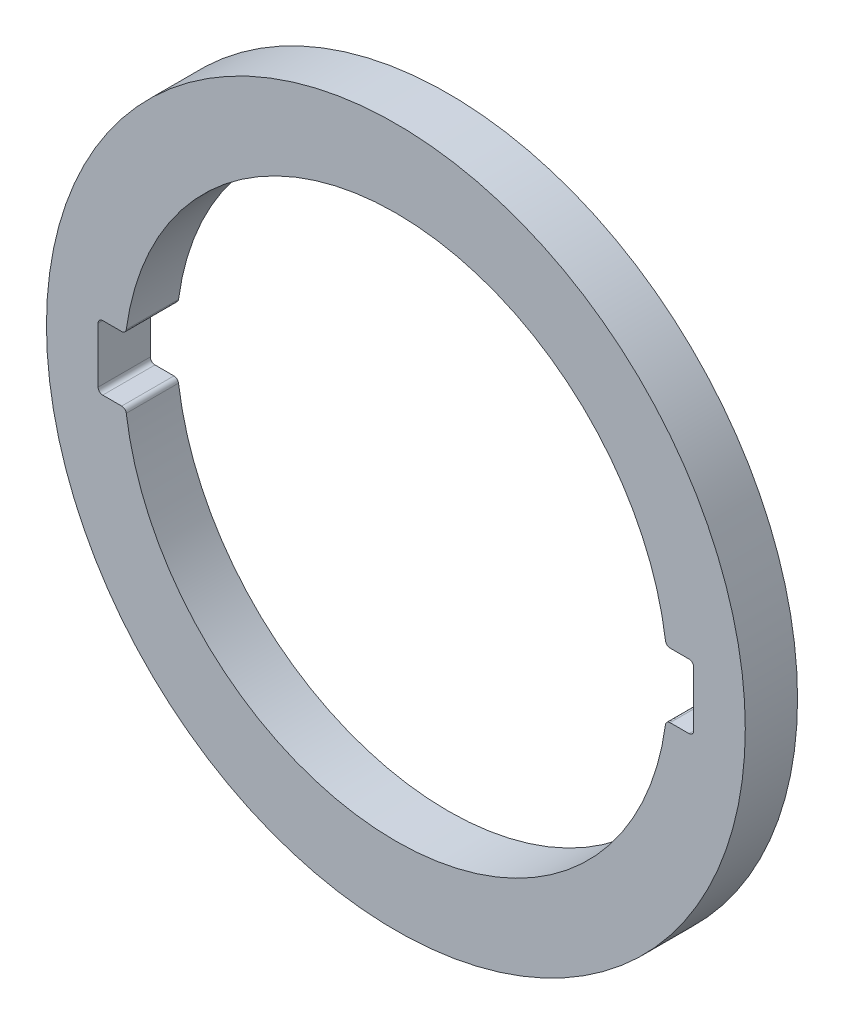
ISO-10303-21;
HEADER;
FILE_DESCRIPTION(('STEP AP214'),'2;1');
FILE_NAME('part.step','',(''),(''),'','','');
FILE_SCHEMA(('AUTOMOTIVE_DESIGN { 1 0 10303 214 1 1 1 1 }'));
ENDSEC;
DATA;
#1=APPLICATION_CONTEXT('core data for automotive mechanical design processes');
#2=APPLICATION_PROTOCOL_DEFINITION('international standard','automotive_design',2000,#1);
#3=PRODUCT_CONTEXT('',#1,'mechanical');
#4=PRODUCT('Part','Part','',(#3));
#5=PRODUCT_RELATED_PRODUCT_CATEGORY('part','',(#4));
#6=PRODUCT_DEFINITION_FORMATION('','',#4);
#7=PRODUCT_DEFINITION_CONTEXT('part definition',#1,'design');
#8=PRODUCT_DEFINITION('design','',#6,#7);
#9=PRODUCT_DEFINITION_SHAPE('','',#8);
#10=(LENGTH_UNIT() NAMED_UNIT(*) SI_UNIT(.MILLI.,.METRE.));
#11=(NAMED_UNIT(*) PLANE_ANGLE_UNIT() SI_UNIT($,.RADIAN.));
#12=(NAMED_UNIT(*) SI_UNIT($,.STERADIAN.) SOLID_ANGLE_UNIT());
#13=UNCERTAINTY_MEASURE_WITH_UNIT(LENGTH_MEASURE(1.E-05),#10,'distance_accuracy_value','');
#14=(GEOMETRIC_REPRESENTATION_CONTEXT(3) GLOBAL_UNCERTAINTY_ASSIGNED_CONTEXT((#13)) GLOBAL_UNIT_ASSIGNED_CONTEXT((#10,
#11,#12)) REPRESENTATION_CONTEXT('',''));
#15=CARTESIAN_POINT('',(0.,0.,0.));
#16=DIRECTION('',(0.,0.,1.));
#17=DIRECTION('',(1.,0.,0.));
#18=AXIS2_PLACEMENT_3D('',#15,#16,#17);
#19=CARTESIAN_POINT('',(-290.901455233013,947.499999999996,-140.));
#20=DIRECTION('',(0.,0.,1.));
#21=DIRECTION('',(1.,0.,0.));
#22=AXIS2_PLACEMENT_3D('',#19,#20,#21);
#23=CYLINDRICAL_SURFACE('',#22,1136.77987900954);
#24=CARTESIAN_POINT('',(-290.901455233013,947.499999999996,-140.));
#25=DIRECTION('',(0.,0.,1.));
#26=DIRECTION('',(1.,0.,0.));
#27=AXIS2_PLACEMENT_3D('',#24,#25,#26);
#28=CIRCLE('',#27,1136.77987900954);
#29=CARTESIAN_POINT('',(845.878423776529,947.499999999996,-140.));
#30=VERTEX_POINT('',#29);
#31=EDGE_CURVE('E238',#30,#30,#28,.T.);
#32=ORIENTED_EDGE('',*,*,#31,.T.);
#33=EDGE_LOOP('',(#32));
#34=FACE_BOUND('',#33,.T.);
#35=CARTESIAN_POINT('',(-290.901455233013,947.499999999996,30.));
#36=DIRECTION('',(0.,0.,1.));
#37=DIRECTION('',(1.,0.,0.));
#38=AXIS2_PLACEMENT_3D('',#35,#36,#37);
#39=CIRCLE('',#38,1136.77987900954);
#40=CARTESIAN_POINT('',(845.878423776529,947.499999999996,30.));
#41=VERTEX_POINT('',#40);
#42=EDGE_CURVE('E203',#41,#41,#39,.T.);
#43=ORIENTED_EDGE('',*,*,#42,.F.);
#44=EDGE_LOOP('',(#43));
#45=FACE_BOUND('',#44,.T.);
#46=ADVANCED_FACE('F36',(#34,#45),#23,.T.);
#47=CARTESIAN_POINT('',(-290.901455233013,947.499999999996,-140.));
#48=DIRECTION('',(0.,0.,1.));
#49=DIRECTION('',(1.,0.,0.));
#50=AXIS2_PLACEMENT_3D('',#47,#48,#49);
#51=PLANE('',#50);
#52=DIRECTION('',(1.,0.,0.));
#53=VECTOR('',#52,1.);
#54=CARTESIAN_POINT('',(-1169.65056618562,842.499999999996,-140.));
#55=LINE('',#54,#53);
#56=CARTESIAN_POINT('',(-1244.65056618562,842.499999999996,-140.));
#57=VERTEX_POINT('',#56);
#58=CARTESIAN_POINT('',(-1182.86558007212,842.499999999996,-140.));
#59=VERTEX_POINT('',#58);
#60=EDGE_CURVE('E170',#57,#59,#55,.T.);
#61=ORIENTED_EDGE('',*,*,#60,.T.);
#62=CARTESIAN_POINT('',(-1182.86558007212,827.499999999996,-140.));
#63=DIRECTION('',(0.,0.,1.));
#64=DIRECTION('',(1.,0.,0.));
#65=AXIS2_PLACEMENT_3D('',#62,#63,#64);
#66=CIRCLE('',#65,15.);
#67=CARTESIAN_POINT('',(-1167.9995113248,829.499999999996,-140.));
#68=VERTEX_POINT('',#67);
#69=EDGE_CURVE('E273',#59,#68,#66,.F.);
#70=ORIENTED_EDGE('',*,*,#69,.T.);
#71=CARTESIAN_POINT('',(-290.901455233013,947.499999999996,-140.));
#72=DIRECTION('',(0.,0.,1.));
#73=DIRECTION('',(1.,0.,0.));
#74=AXIS2_PLACEMENT_3D('',#71,#72,#73);
#75=CIRCLE('',#74,885.);
#76=CARTESIAN_POINT('',(586.196600858779,829.499999999996,-140.));
#77=VERTEX_POINT('',#76);
#78=EDGE_CURVE('E206',#68,#77,#75,.T.);
#79=ORIENTED_EDGE('',*,*,#78,.T.);
#80=CARTESIAN_POINT('',(601.062669606097,827.499999999996,-140.));
#81=DIRECTION('',(0.,0.,1.));
#82=DIRECTION('',(1.,0.,0.));
#83=AXIS2_PLACEMENT_3D('',#80,#81,#82);
#84=CIRCLE('',#83,15.);
#85=CARTESIAN_POINT('',(601.062669606097,842.499999999996,-140.));
#86=VERTEX_POINT('',#85);
#87=EDGE_CURVE('E270',#77,#86,#84,.F.);
#88=ORIENTED_EDGE('',*,*,#87,.T.);
#89=DIRECTION('',(1.,0.,0.));
#90=VECTOR('',#89,1.);
#91=CARTESIAN_POINT('',(587.847655719596,842.499999999996,-140.));
#92=LINE('',#91,#90);
#93=CARTESIAN_POINT('',(662.847655719595,842.499999999996,-140.));
#94=VERTEX_POINT('',#93);
#95=EDGE_CURVE('E209',#86,#94,#92,.T.);
#96=ORIENTED_EDGE('',*,*,#95,.T.);
#97=CARTESIAN_POINT('',(662.847655719595,857.499999999996,-140.));
#98=DIRECTION('',(0.,0.,1.));
#99=DIRECTION('',(1.,0.,0.));
#100=AXIS2_PLACEMENT_3D('',#97,#98,#99);
#101=CIRCLE('',#100,15.);
#102=CARTESIAN_POINT('',(677.847655719596,857.499999999996,-140.));
#103=VERTEX_POINT('',#102);
#104=EDGE_CURVE('E168',#94,#103,#101,.T.);
#105=ORIENTED_EDGE('',*,*,#104,.T.);
#106=DIRECTION('',(0.,1.,0.));
#107=VECTOR('',#106,1.);
#108=CARTESIAN_POINT('',(677.847655719596,857.499999999996,-140.));
#109=LINE('',#108,#107);
#110=CARTESIAN_POINT('',(677.847655719596,1037.5,-140.));
#111=VERTEX_POINT('',#110);
#112=EDGE_CURVE('E212',#103,#111,#109,.T.);
#113=ORIENTED_EDGE('',*,*,#112,.T.);
#114=CARTESIAN_POINT('',(662.847655719595,1037.5,-140.));
#115=DIRECTION('',(0.,0.,1.));
#116=DIRECTION('',(1.,0.,0.));
#117=AXIS2_PLACEMENT_3D('',#114,#115,#116);
#118=CIRCLE('',#117,15.);
#119=CARTESIAN_POINT('',(662.847655719595,1052.5,-140.));
#120=VERTEX_POINT('',#119);
#121=EDGE_CURVE('E215',#111,#120,#118,.T.);
#122=ORIENTED_EDGE('',*,*,#121,.T.);
#123=DIRECTION('',(-1.,0.,0.));
#124=VECTOR('',#123,1.);
#125=CARTESIAN_POINT('',(662.847655719595,1052.5,-140.));
#126=LINE('',#125,#124);
#127=CARTESIAN_POINT('',(601.062669606097,1052.5,-140.));
#128=VERTEX_POINT('',#127);
#129=EDGE_CURVE('E218',#120,#128,#126,.T.);
#130=ORIENTED_EDGE('',*,*,#129,.T.);
#131=CARTESIAN_POINT('',(601.062669606097,1067.5,-140.));
#132=DIRECTION('',(0.,0.,1.));
#133=DIRECTION('',(1.,0.,0.));
#134=AXIS2_PLACEMENT_3D('',#131,#132,#133);
#135=CIRCLE('',#134,15.);
#136=CARTESIAN_POINT('',(586.196600858779,1065.5,-140.));
#137=VERTEX_POINT('',#136);
#138=EDGE_CURVE('E268',#128,#137,#135,.F.);
#139=ORIENTED_EDGE('',*,*,#138,.T.);
#140=CARTESIAN_POINT('',(-290.901455233013,947.499999999996,-140.));
#141=DIRECTION('',(0.,0.,1.));
#142=DIRECTION('',(1.,0.,0.));
#143=AXIS2_PLACEMENT_3D('',#140,#141,#142);
#144=CIRCLE('',#143,885.);
#145=CARTESIAN_POINT('',(-1167.9995113248,1065.5,-140.));
#146=VERTEX_POINT('',#145);
#147=EDGE_CURVE('E221',#137,#146,#144,.T.);
#148=ORIENTED_EDGE('',*,*,#147,.T.);
#149=CARTESIAN_POINT('',(-1182.86558007212,1067.5,-140.));
#150=DIRECTION('',(0.,0.,1.));
#151=DIRECTION('',(1.,0.,0.));
#152=AXIS2_PLACEMENT_3D('',#149,#150,#151);
#153=CIRCLE('',#152,15.);
#154=CARTESIAN_POINT('',(-1182.86558007212,1052.5,-140.));
#155=VERTEX_POINT('',#154);
#156=EDGE_CURVE('E51',#146,#155,#153,.F.);
#157=ORIENTED_EDGE('',*,*,#156,.T.);
#158=DIRECTION('',(-1.,0.,0.));
#159=VECTOR('',#158,1.);
#160=CARTESIAN_POINT('',(-1244.65056618562,1052.5,-140.));
#161=LINE('',#160,#159);
#162=CARTESIAN_POINT('',(-1244.65056618562,1052.5,-140.));
#163=VERTEX_POINT('',#162);
#164=EDGE_CURVE('E223',#155,#163,#161,.T.);
#165=ORIENTED_EDGE('',*,*,#164,.T.);
#166=CARTESIAN_POINT('',(-1244.65056618562,1037.5,-140.));
#167=DIRECTION('',(0.,0.,1.));
#168=DIRECTION('',(-1.,0.,0.));
#169=AXIS2_PLACEMENT_3D('',#166,#167,#168);
#170=CIRCLE('',#169,15.);
#171=CARTESIAN_POINT('',(-1259.65056618562,1037.5,-140.));
#172=VERTEX_POINT('',#171);
#173=EDGE_CURVE('E225',#163,#172,#170,.T.);
#174=ORIENTED_EDGE('',*,*,#173,.T.);
#175=DIRECTION('',(0.,-1.,0.));
#176=VECTOR('',#175,1.);
#177=CARTESIAN_POINT('',(-1259.65056618562,857.499999999996,-140.));
#178=LINE('',#177,#176);
#179=CARTESIAN_POINT('',(-1259.65056618562,857.499999999996,-140.));
#180=VERTEX_POINT('',#179);
#181=EDGE_CURVE('E228',#172,#180,#178,.T.);
#182=ORIENTED_EDGE('',*,*,#181,.T.);
#183=CARTESIAN_POINT('',(-1244.65056618562,857.499999999996,-140.));
#184=DIRECTION('',(0.,0.,1.));
#185=DIRECTION('',(-1.,0.,0.));
#186=AXIS2_PLACEMENT_3D('',#183,#184,#185);
#187=CIRCLE('',#186,15.0000000000001);
#188=EDGE_CURVE('E231',#180,#57,#187,.T.);
#189=ORIENTED_EDGE('',*,*,#188,.T.);
#190=EDGE_LOOP('',(#61,#70,#79,#88,#96,#105,#113,#122,#130,#139,#148,#157,#165,#174,#182,#189));
#191=FACE_BOUND('',#190,.T.);
#192=ORIENTED_EDGE('',*,*,#31,.F.);
#193=EDGE_LOOP('',(#192));
#194=FACE_BOUND('',#193,.T.);
#195=ADVANCED_FACE('F296',(#191,#194),#51,.F.);
#196=CARTESIAN_POINT('',(-290.901455233013,947.499999999996,-140.));
#197=DIRECTION('',(0.,0.,1.));
#198=DIRECTION('',(1.,0.,0.));
#199=AXIS2_PLACEMENT_3D('',#196,#197,#198);
#200=CYLINDRICAL_SURFACE('',#199,885.);
#201=ORIENTED_EDGE('',*,*,#78,.F.);
#202=DIRECTION('',(0.,0.,1.));
#203=VECTOR('',#202,1.);
#204=CARTESIAN_POINT('',(-1167.9995113248,829.499999999996,-140.));
#205=LINE('',#204,#203);
#206=CARTESIAN_POINT('',(-1167.9995113248,829.499999999996,30.));
#207=VERTEX_POINT('',#206);
#208=EDGE_CURVE('E255',#68,#207,#205,.T.);
#209=ORIENTED_EDGE('',*,*,#208,.T.);
#210=CARTESIAN_POINT('',(-290.901455233013,947.499999999996,30.));
#211=DIRECTION('',(0.,0.,1.));
#212=DIRECTION('',(1.,0.,0.));
#213=AXIS2_PLACEMENT_3D('',#210,#211,#212);
#214=CIRCLE('',#213,885.);
#215=CARTESIAN_POINT('',(586.196600858779,829.499999999996,30.));
#216=VERTEX_POINT('',#215);
#217=EDGE_CURVE('E160',#207,#216,#214,.T.);
#218=ORIENTED_EDGE('',*,*,#217,.T.);
#219=DIRECTION('',(0.,0.,1.));
#220=VECTOR('',#219,1.);
#221=CARTESIAN_POINT('',(586.196600858779,829.499999999996,-140.));
#222=LINE('',#221,#220);
#223=EDGE_CURVE('E253',#216,#77,#222,.F.);
#224=ORIENTED_EDGE('',*,*,#223,.T.);
#225=EDGE_LOOP('',(#201,#209,#218,#224));
#226=FACE_BOUND('',#225,.T.);
#227=ADVANCED_FACE('F318',(#226),#200,.F.);
#228=CARTESIAN_POINT('',(-1169.65056618562,842.499999999996,-140.));
#229=DIRECTION('',(0.,-1.,0.));
#230=DIRECTION('',(0.,0.,-1.));
#231=AXIS2_PLACEMENT_3D('',#228,#229,#230);
#232=PLANE('',#231);
#233=DIRECTION('',(1.,0.,0.));
#234=VECTOR('',#233,1.);
#235=CARTESIAN_POINT('',(-1169.65056618562,842.499999999996,30.));
#236=LINE('',#235,#234);
#237=CARTESIAN_POINT('',(-1244.65056618562,842.499999999996,30.));
#238=VERTEX_POINT('',#237);
#239=CARTESIAN_POINT('',(-1182.86558007212,842.499999999996,30.));
#240=VERTEX_POINT('',#239);
#241=EDGE_CURVE('E200',#238,#240,#236,.T.);
#242=ORIENTED_EDGE('',*,*,#241,.T.);
#243=DIRECTION('',(0.,0.,1.));
#244=VECTOR('',#243,1.);
#245=CARTESIAN_POINT('',(-1182.86558007212,842.499999999996,-140.));
#246=LINE('',#245,#244);
#247=EDGE_CURVE('E266',#240,#59,#246,.F.);
#248=ORIENTED_EDGE('',*,*,#247,.T.);
#249=ORIENTED_EDGE('',*,*,#60,.F.);
#250=DIRECTION('',(0.,0.,1.));
#251=VECTOR('',#250,1.);
#252=CARTESIAN_POINT('',(-1244.65056618562,842.499999999996,-140.));
#253=LINE('',#252,#251);
#254=EDGE_CURVE('E236',#57,#238,#253,.T.);
#255=ORIENTED_EDGE('',*,*,#254,.T.);
#256=EDGE_LOOP('',(#242,#248,#249,#255));
#257=FACE_BOUND('',#256,.T.);
#258=ADVANCED_FACE('F452',(#257),#232,.F.);
#259=CARTESIAN_POINT('',(-1244.65056618562,857.499999999996,-140.));
#260=DIRECTION('',(0.,0.,1.));
#261=DIRECTION('',(1.,0.,0.));
#262=AXIS2_PLACEMENT_3D('',#259,#260,#261);
#263=CYLINDRICAL_SURFACE('',#262,15.0000000000001);
#264=DIRECTION('',(0.,0.,1.));
#265=VECTOR('',#264,1.);
#266=CARTESIAN_POINT('',(-1259.65056618562,857.499999999996,-140.));
#267=LINE('',#266,#265);
#268=CARTESIAN_POINT('',(-1259.65056618562,857.499999999996,30.));
#269=VERTEX_POINT('',#268);
#270=EDGE_CURVE('E239',#180,#269,#267,.T.);
#271=ORIENTED_EDGE('',*,*,#270,.T.);
#272=CARTESIAN_POINT('',(-1244.65056618562,857.499999999996,30.));
#273=DIRECTION('',(0.,0.,1.));
#274=DIRECTION('',(-1.,0.,0.));
#275=AXIS2_PLACEMENT_3D('',#272,#273,#274);
#276=CIRCLE('',#275,15.0000000000001);
#277=EDGE_CURVE('E197',#269,#238,#276,.T.);
#278=ORIENTED_EDGE('',*,*,#277,.T.);
#279=ORIENTED_EDGE('',*,*,#254,.F.);
#280=ORIENTED_EDGE('',*,*,#188,.F.);
#281=EDGE_LOOP('',(#271,#278,#279,#280));
#282=FACE_BOUND('',#281,.T.);
#283=ADVANCED_FACE('F307',(#282),#263,.F.);
#284=CARTESIAN_POINT('',(-1259.65056618562,857.499999999996,-140.));
#285=DIRECTION('',(-1.,0.,0.));
#286=DIRECTION('',(0.,0.,1.));
#287=AXIS2_PLACEMENT_3D('',#284,#285,#286);
#288=PLANE('',#287);
#289=DIRECTION('',(0.,0.,1.));
#290=VECTOR('',#289,1.);
#291=CARTESIAN_POINT('',(-1259.65056618562,1037.5,-140.));
#292=LINE('',#291,#290);
#293=CARTESIAN_POINT('',(-1259.65056618562,1037.5,30.));
#294=VERTEX_POINT('',#293);
#295=EDGE_CURVE('E241',#172,#294,#292,.T.);
#296=ORIENTED_EDGE('',*,*,#295,.T.);
#297=DIRECTION('',(0.,-1.,0.));
#298=VECTOR('',#297,1.);
#299=CARTESIAN_POINT('',(-1259.65056618562,857.499999999996,30.));
#300=LINE('',#299,#298);
#301=EDGE_CURVE('E194',#294,#269,#300,.T.);
#302=ORIENTED_EDGE('',*,*,#301,.T.);
#303=ORIENTED_EDGE('',*,*,#270,.F.);
#304=ORIENTED_EDGE('',*,*,#181,.F.);
#305=EDGE_LOOP('',(#296,#302,#303,#304));
#306=FACE_BOUND('',#305,.T.);
#307=ADVANCED_FACE('F303',(#306),#288,.F.);
#308=CARTESIAN_POINT('',(-1244.65056618562,1037.5,-140.));
#309=DIRECTION('',(0.,0.,1.));
#310=DIRECTION('',(1.,0.,0.));
#311=AXIS2_PLACEMENT_3D('',#308,#309,#310);
#312=CYLINDRICAL_SURFACE('',#311,15.);
#313=DIRECTION('',(0.,0.,1.));
#314=VECTOR('',#313,1.);
#315=CARTESIAN_POINT('',(-1244.65056618562,1052.5,-140.));
#316=LINE('',#315,#314);
#317=CARTESIAN_POINT('',(-1244.65056618562,1052.5,30.));
#318=VERTEX_POINT('',#317);
#319=EDGE_CURVE('E243',#163,#318,#316,.T.);
#320=ORIENTED_EDGE('',*,*,#319,.T.);
#321=CARTESIAN_POINT('',(-1244.65056618562,1037.5,30.));
#322=DIRECTION('',(0.,0.,1.));
#323=DIRECTION('',(-1.,0.,0.));
#324=AXIS2_PLACEMENT_3D('',#321,#322,#323);
#325=CIRCLE('',#324,15.);
#326=EDGE_CURVE('E191',#318,#294,#325,.T.);
#327=ORIENTED_EDGE('',*,*,#326,.T.);
#328=ORIENTED_EDGE('',*,*,#295,.F.);
#329=ORIENTED_EDGE('',*,*,#173,.F.);
#330=EDGE_LOOP('',(#320,#327,#328,#329));
#331=FACE_BOUND('',#330,.T.);
#332=ADVANCED_FACE('F300',(#331),#312,.F.);
#333=CARTESIAN_POINT('',(-1244.65056618562,1052.5,-140.));
#334=DIRECTION('',(0.,1.,0.));
#335=DIRECTION('',(0.,0.,1.));
#336=AXIS2_PLACEMENT_3D('',#333,#334,#335);
#337=PLANE('',#336);
#338=ORIENTED_EDGE('',*,*,#164,.F.);
#339=DIRECTION('',(0.,0.,1.));
#340=VECTOR('',#339,1.);
#341=CARTESIAN_POINT('',(-1182.86558007212,1052.5,-140.));
#342=LINE('',#341,#340);
#343=CARTESIAN_POINT('',(-1182.86558007212,1052.5,30.));
#344=VERTEX_POINT('',#343);
#345=EDGE_CURVE('E275',#155,#344,#342,.T.);
#346=ORIENTED_EDGE('',*,*,#345,.T.);
#347=DIRECTION('',(-1.,0.,0.));
#348=VECTOR('',#347,1.);
#349=CARTESIAN_POINT('',(-1244.65056618562,1052.5,30.));
#350=LINE('',#349,#348);
#351=EDGE_CURVE('E189',#344,#318,#350,.T.);
#352=ORIENTED_EDGE('',*,*,#351,.T.);
#353=ORIENTED_EDGE('',*,*,#319,.F.);
#354=EDGE_LOOP('',(#338,#346,#352,#353));
#355=FACE_BOUND('',#354,.T.);
#356=ADVANCED_FACE('F293',(#355),#337,.F.);
#357=CARTESIAN_POINT('',(-290.901455233013,947.499999999996,-140.));
#358=DIRECTION('',(0.,0.,1.));
#359=DIRECTION('',(1.,0.,0.));
#360=AXIS2_PLACEMENT_3D('',#357,#358,#359);
#361=CYLINDRICAL_SURFACE('',#360,885.);
#362=CARTESIAN_POINT('',(-290.901455233013,947.499999999996,30.));
#363=DIRECTION('',(0.,0.,1.));
#364=DIRECTION('',(1.,0.,0.));
#365=AXIS2_PLACEMENT_3D('',#362,#363,#364);
#366=CIRCLE('',#365,885.);
#367=CARTESIAN_POINT('',(586.196600858779,1065.5,30.));
#368=VERTEX_POINT('',#367);
#369=CARTESIAN_POINT('',(-1167.9995113248,1065.5,30.));
#370=VERTEX_POINT('',#369);
#371=EDGE_CURVE('E187',#368,#370,#366,.T.);
#372=ORIENTED_EDGE('',*,*,#371,.T.);
#373=DIRECTION('',(0.,0.,1.));
#374=VECTOR('',#373,1.);
#375=CARTESIAN_POINT('',(-1167.9995113248,1065.5,-140.));
#376=LINE('',#375,#374);
#377=EDGE_CURVE('E59',#370,#146,#376,.F.);
#378=ORIENTED_EDGE('',*,*,#377,.T.);
#379=ORIENTED_EDGE('',*,*,#147,.F.);
#380=DIRECTION('',(0.,0.,1.));
#381=VECTOR('',#380,1.);
#382=CARTESIAN_POINT('',(586.196600858779,1065.5,-140.));
#383=LINE('',#382,#381);
#384=EDGE_CURVE('E278',#137,#368,#383,.T.);
#385=ORIENTED_EDGE('',*,*,#384,.T.);
#386=EDGE_LOOP('',(#372,#378,#379,#385));
#387=FACE_BOUND('',#386,.T.);
#388=ADVANCED_FACE('F283',(#387),#361,.F.);
#389=CARTESIAN_POINT('',(662.847655719595,1052.5,-140.));
#390=DIRECTION('',(0.,1.,0.));
#391=DIRECTION('',(0.,0.,1.));
#392=AXIS2_PLACEMENT_3D('',#389,#390,#391);
#393=PLANE('',#392);
#394=DIRECTION('',(-1.,0.,0.));
#395=VECTOR('',#394,1.);
#396=CARTESIAN_POINT('',(662.847655719595,1052.5,30.));
#397=LINE('',#396,#395);
#398=CARTESIAN_POINT('',(662.847655719595,1052.5,30.));
#399=VERTEX_POINT('',#398);
#400=CARTESIAN_POINT('',(601.062669606097,1052.5,30.));
#401=VERTEX_POINT('',#400);
#402=EDGE_CURVE('E184',#399,#401,#397,.T.);
#403=ORIENTED_EDGE('',*,*,#402,.T.);
#404=DIRECTION('',(0.,0.,1.));
#405=VECTOR('',#404,1.);
#406=CARTESIAN_POINT('',(601.062669606097,1052.5,-140.));
#407=LINE('',#406,#405);
#408=EDGE_CURVE('E11',#401,#128,#407,.F.);
#409=ORIENTED_EDGE('',*,*,#408,.T.);
#410=ORIENTED_EDGE('',*,*,#129,.F.);
#411=DIRECTION('',(0.,0.,1.));
#412=VECTOR('',#411,1.);
#413=CARTESIAN_POINT('',(662.847655719595,1052.5,-140.));
#414=LINE('',#413,#412);
#415=EDGE_CURVE('E246',#120,#399,#414,.T.);
#416=ORIENTED_EDGE('',*,*,#415,.T.);
#417=EDGE_LOOP('',(#403,#409,#410,#416));
#418=FACE_BOUND('',#417,.T.);
#419=ADVANCED_FACE('F332',(#418),#393,.F.);
#420=CARTESIAN_POINT('',(662.847655719595,1037.5,-140.));
#421=DIRECTION('',(0.,0.,1.));
#422=DIRECTION('',(1.,0.,0.));
#423=AXIS2_PLACEMENT_3D('',#420,#421,#422);
#424=CYLINDRICAL_SURFACE('',#423,15.);
#425=DIRECTION('',(0.,0.,1.));
#426=VECTOR('',#425,1.);
#427=CARTESIAN_POINT('',(677.847655719596,1037.5,-140.));
#428=LINE('',#427,#426);
#429=CARTESIAN_POINT('',(677.847655719596,1037.5,30.));
#430=VERTEX_POINT('',#429);
#431=EDGE_CURVE('E248',#111,#430,#428,.T.);
#432=ORIENTED_EDGE('',*,*,#431,.T.);
#433=CARTESIAN_POINT('',(662.847655719595,1037.5,30.));
#434=DIRECTION('',(0.,0.,1.));
#435=DIRECTION('',(1.,0.,0.));
#436=AXIS2_PLACEMENT_3D('',#433,#434,#435);
#437=CIRCLE('',#436,15.);
#438=EDGE_CURVE('E178',#430,#399,#437,.T.);
#439=ORIENTED_EDGE('',*,*,#438,.T.);
#440=ORIENTED_EDGE('',*,*,#415,.F.);
#441=ORIENTED_EDGE('',*,*,#121,.F.);
#442=EDGE_LOOP('',(#432,#439,#440,#441));
#443=FACE_BOUND('',#442,.T.);
#444=ADVANCED_FACE('F329',(#443),#424,.F.);
#445=CARTESIAN_POINT('',(677.847655719596,857.499999999996,-140.));
#446=DIRECTION('',(1.,0.,0.));
#447=DIRECTION('',(0.,0.,-1.));
#448=AXIS2_PLACEMENT_3D('',#445,#446,#447);
#449=PLANE('',#448);
#450=DIRECTION('',(0.,0.,1.));
#451=VECTOR('',#450,1.);
#452=CARTESIAN_POINT('',(677.847655719596,857.499999999996,-140.));
#453=LINE('',#452,#451);
#454=CARTESIAN_POINT('',(677.847655719596,857.499999999996,30.));
#455=VERTEX_POINT('',#454);
#456=EDGE_CURVE('E169',#103,#455,#453,.T.);
#457=ORIENTED_EDGE('',*,*,#456,.T.);
#458=DIRECTION('',(0.,1.,0.));
#459=VECTOR('',#458,1.);
#460=CARTESIAN_POINT('',(677.847655719596,857.499999999996,30.));
#461=LINE('',#460,#459);
#462=EDGE_CURVE('E176',#455,#430,#461,.T.);
#463=ORIENTED_EDGE('',*,*,#462,.T.);
#464=ORIENTED_EDGE('',*,*,#431,.F.);
#465=ORIENTED_EDGE('',*,*,#112,.F.);
#466=EDGE_LOOP('',(#457,#463,#464,#465));
#467=FACE_BOUND('',#466,.T.);
#468=ADVANCED_FACE('F327',(#467),#449,.F.);
#469=CARTESIAN_POINT('',(662.847655719595,857.499999999996,-140.));
#470=DIRECTION('',(0.,0.,1.));
#471=DIRECTION('',(1.,0.,0.));
#472=AXIS2_PLACEMENT_3D('',#469,#470,#471);
#473=CYLINDRICAL_SURFACE('',#472,15.);
#474=DIRECTION('',(0.,0.,1.));
#475=VECTOR('',#474,1.);
#476=CARTESIAN_POINT('',(662.847655719595,842.499999999996,-140.));
#477=LINE('',#476,#475);
#478=CARTESIAN_POINT('',(662.847655719595,842.499999999996,30.));
#479=VERTEX_POINT('',#478);
#480=EDGE_CURVE('E155',#94,#479,#477,.T.);
#481=ORIENTED_EDGE('',*,*,#480,.T.);
#482=CARTESIAN_POINT('',(662.847655719595,857.499999999996,30.));
#483=DIRECTION('',(0.,0.,1.));
#484=DIRECTION('',(1.,0.,0.));
#485=AXIS2_PLACEMENT_3D('',#482,#483,#484);
#486=CIRCLE('',#485,15.);
#487=EDGE_CURVE('E159',#479,#455,#486,.T.);
#488=ORIENTED_EDGE('',*,*,#487,.T.);
#489=ORIENTED_EDGE('',*,*,#456,.F.);
#490=ORIENTED_EDGE('',*,*,#104,.F.);
#491=EDGE_LOOP('',(#481,#488,#489,#490));
#492=FACE_BOUND('',#491,.T.);
#493=ADVANCED_FACE('F165',(#492),#473,.F.);
#494=CARTESIAN_POINT('',(587.847655719596,842.499999999996,-140.));
#495=DIRECTION('',(0.,-1.,0.));
#496=DIRECTION('',(0.,0.,-1.));
#497=AXIS2_PLACEMENT_3D('',#494,#495,#496);
#498=PLANE('',#497);
#499=ORIENTED_EDGE('',*,*,#95,.F.);
#500=DIRECTION('',(0.,0.,1.));
#501=VECTOR('',#500,1.);
#502=CARTESIAN_POINT('',(601.062669606097,842.499999999996,-140.));
#503=LINE('',#502,#501);
#504=CARTESIAN_POINT('',(601.062669606097,842.499999999996,30.));
#505=VERTEX_POINT('',#504);
#506=EDGE_CURVE('E44',#86,#505,#503,.T.);
#507=ORIENTED_EDGE('',*,*,#506,.T.);
#508=DIRECTION('',(1.,0.,0.));
#509=VECTOR('',#508,1.);
#510=CARTESIAN_POINT('',(587.847655719596,842.499999999996,30.));
#511=LINE('',#510,#509);
#512=EDGE_CURVE('E151',#505,#479,#511,.T.);
#513=ORIENTED_EDGE('',*,*,#512,.T.);
#514=ORIENTED_EDGE('',*,*,#480,.F.);
#515=EDGE_LOOP('',(#499,#507,#513,#514));
#516=FACE_BOUND('',#515,.T.);
#517=ADVANCED_FACE('F154',(#516),#498,.F.);
#518=CARTESIAN_POINT('',(-290.901455233013,947.499999999996,30.));
#519=DIRECTION('',(0.,0.,1.));
#520=DIRECTION('',(1.,0.,0.));
#521=AXIS2_PLACEMENT_3D('',#518,#519,#520);
#522=PLANE('',#521);
#523=ORIENTED_EDGE('',*,*,#42,.T.);
#524=EDGE_LOOP('',(#523));
#525=FACE_BOUND('',#524,.T.);
#526=ORIENTED_EDGE('',*,*,#217,.F.);
#527=CARTESIAN_POINT('',(-1182.86558007212,827.499999999996,30.));
#528=DIRECTION('',(0.,0.,1.));
#529=DIRECTION('',(1.,0.,0.));
#530=AXIS2_PLACEMENT_3D('',#527,#528,#529);
#531=CIRCLE('',#530,15.);
#532=EDGE_CURVE('E264',#207,#240,#531,.T.);
#533=ORIENTED_EDGE('',*,*,#532,.T.);
#534=ORIENTED_EDGE('',*,*,#241,.F.);
#535=ORIENTED_EDGE('',*,*,#277,.F.);
#536=ORIENTED_EDGE('',*,*,#301,.F.);
#537=ORIENTED_EDGE('',*,*,#326,.F.);
#538=ORIENTED_EDGE('',*,*,#351,.F.);
#539=CARTESIAN_POINT('',(-1182.86558007212,1067.5,30.));
#540=DIRECTION('',(0.,0.,1.));
#541=DIRECTION('',(1.,0.,0.));
#542=AXIS2_PLACEMENT_3D('',#539,#540,#541);
#543=CIRCLE('',#542,15.);
#544=EDGE_CURVE('E262',#344,#370,#543,.T.);
#545=ORIENTED_EDGE('',*,*,#544,.T.);
#546=ORIENTED_EDGE('',*,*,#371,.F.);
#547=CARTESIAN_POINT('',(601.062669606097,1067.5,30.));
#548=DIRECTION('',(0.,0.,1.));
#549=DIRECTION('',(1.,0.,0.));
#550=AXIS2_PLACEMENT_3D('',#547,#548,#549);
#551=CIRCLE('',#550,15.);
#552=EDGE_CURVE('E258',#368,#401,#551,.T.);
#553=ORIENTED_EDGE('',*,*,#552,.T.);
#554=ORIENTED_EDGE('',*,*,#402,.F.);
#555=ORIENTED_EDGE('',*,*,#438,.F.);
#556=ORIENTED_EDGE('',*,*,#462,.F.);
#557=ORIENTED_EDGE('',*,*,#487,.F.);
#558=ORIENTED_EDGE('',*,*,#512,.F.);
#559=CARTESIAN_POINT('',(601.062669606097,827.499999999996,30.));
#560=DIRECTION('',(0.,0.,1.));
#561=DIRECTION('',(1.,0.,0.));
#562=AXIS2_PLACEMENT_3D('',#559,#560,#561);
#563=CIRCLE('',#562,15.);
#564=EDGE_CURVE('E260',#505,#216,#563,.T.);
#565=ORIENTED_EDGE('',*,*,#564,.T.);
#566=EDGE_LOOP('',(#526,#533,#534,#535,#536,#537,#538,#545,#546,#553,#554,#555,#556,#557,#558,#565));
#567=FACE_BOUND('',#566,.T.);
#568=ADVANCED_FACE('F173',(#525,#567),#522,.T.);
#569=CARTESIAN_POINT('',(-1182.86558007212,827.499999999996,-140.));
#570=DIRECTION('',(0.,0.,1.));
#571=DIRECTION('',(1.,0.,0.));
#572=AXIS2_PLACEMENT_3D('',#569,#570,#571);
#573=CYLINDRICAL_SURFACE('',#572,15.);
#574=ORIENTED_EDGE('',*,*,#69,.F.);
#575=ORIENTED_EDGE('',*,*,#247,.F.);
#576=ORIENTED_EDGE('',*,*,#532,.F.);
#577=ORIENTED_EDGE('',*,*,#208,.F.);
#578=EDGE_LOOP('',(#574,#575,#576,#577));
#579=FACE_BOUND('',#578,.T.);
#580=ADVANCED_FACE('F315',(#579),#573,.T.);
#581=CARTESIAN_POINT('',(-1182.86558007212,1067.5,-140.));
#582=DIRECTION('',(0.,0.,1.));
#583=DIRECTION('',(1.,0.,0.));
#584=AXIS2_PLACEMENT_3D('',#581,#582,#583);
#585=CYLINDRICAL_SURFACE('',#584,15.);
#586=ORIENTED_EDGE('',*,*,#156,.F.);
#587=ORIENTED_EDGE('',*,*,#377,.F.);
#588=ORIENTED_EDGE('',*,*,#544,.F.);
#589=ORIENTED_EDGE('',*,*,#345,.F.);
#590=EDGE_LOOP('',(#586,#587,#588,#589));
#591=FACE_BOUND('',#590,.T.);
#592=ADVANCED_FACE('F291',(#591),#585,.T.);
#593=CARTESIAN_POINT('',(601.062669606097,827.499999999996,-140.));
#594=DIRECTION('',(0.,0.,1.));
#595=DIRECTION('',(1.,0.,0.));
#596=AXIS2_PLACEMENT_3D('',#593,#594,#595);
#597=CYLINDRICAL_SURFACE('',#596,15.);
#598=ORIENTED_EDGE('',*,*,#87,.F.);
#599=ORIENTED_EDGE('',*,*,#223,.F.);
#600=ORIENTED_EDGE('',*,*,#564,.F.);
#601=ORIENTED_EDGE('',*,*,#506,.F.);
#602=EDGE_LOOP('',(#598,#599,#600,#601));
#603=FACE_BOUND('',#602,.T.);
#604=ADVANCED_FACE('F323',(#603),#597,.T.);
#605=CARTESIAN_POINT('',(601.062669606097,1067.5,-140.));
#606=DIRECTION('',(0.,0.,1.));
#607=DIRECTION('',(1.,0.,0.));
#608=AXIS2_PLACEMENT_3D('',#605,#606,#607);
#609=CYLINDRICAL_SURFACE('',#608,15.);
#610=ORIENTED_EDGE('',*,*,#138,.F.);
#611=ORIENTED_EDGE('',*,*,#408,.F.);
#612=ORIENTED_EDGE('',*,*,#552,.F.);
#613=ORIENTED_EDGE('',*,*,#384,.F.);
#614=EDGE_LOOP('',(#610,#611,#612,#613));
#615=FACE_BOUND('',#614,.T.);
#616=ADVANCED_FACE('F38',(#615),#609,.T.);
#617=CLOSED_SHELL('',(#46,#195,#227,#258,#283,#307,#332,#356,#388,#419,#444,#468,#493,#517,#568,
#580,#592,#604,#616));
#618=MANIFOLD_SOLID_BREP('B2',#617);
#619=ADVANCED_BREP_SHAPE_REPRESENTATION('',(#18,#618),#14);
#620=SHAPE_DEFINITION_REPRESENTATION(#9,#619);
ENDSEC;
END-ISO-10303-21;
